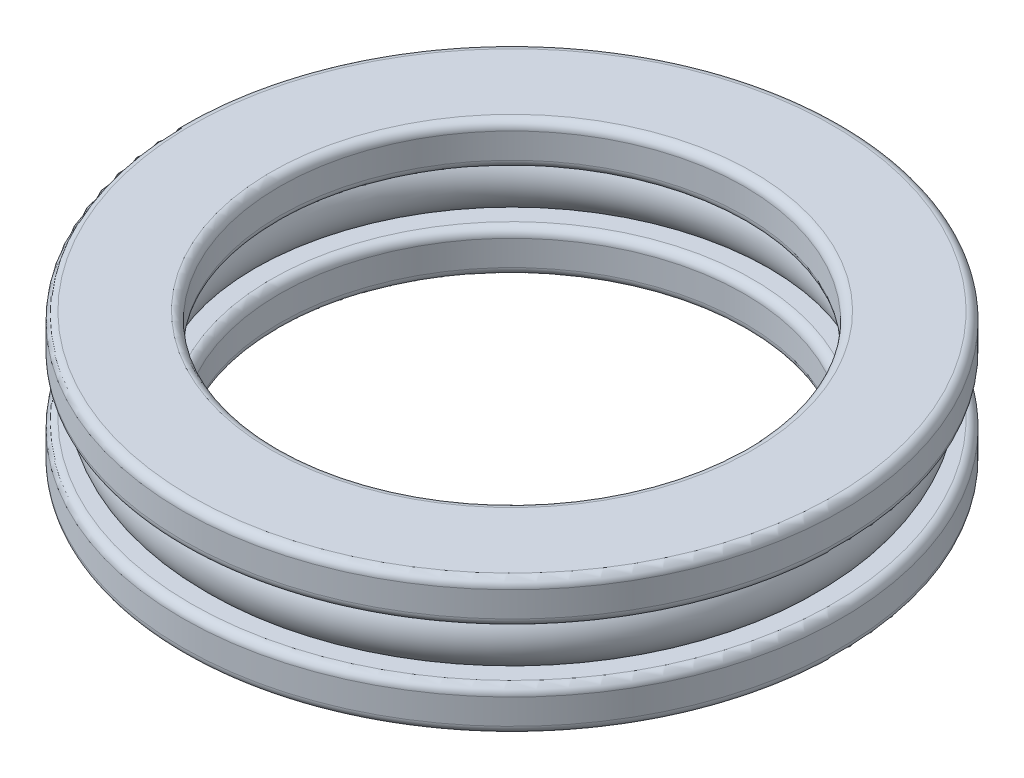
ISO-10303-21;
HEADER;
FILE_DESCRIPTION(('STEP AP214'),'2;1');
FILE_NAME('part.step','',(''),(''),'','','');
FILE_SCHEMA(('AUTOMOTIVE_DESIGN { 1 0 10303 214 1 1 1 1 }'));
ENDSEC;
DATA;
#1=APPLICATION_CONTEXT('core data for automotive mechanical design processes');
#2=APPLICATION_PROTOCOL_DEFINITION('international standard','automotive_design',2000,#1);
#3=PRODUCT_CONTEXT('',#1,'mechanical');
#4=PRODUCT('Part','Part','',(#3));
#5=PRODUCT_RELATED_PRODUCT_CATEGORY('part','',(#4));
#6=PRODUCT_DEFINITION_FORMATION('','',#4);
#7=PRODUCT_DEFINITION_CONTEXT('part definition',#1,'design');
#8=PRODUCT_DEFINITION('design','',#6,#7);
#9=PRODUCT_DEFINITION_SHAPE('','',#8);
#10=(LENGTH_UNIT() NAMED_UNIT(*) SI_UNIT(.MILLI.,.METRE.));
#11=(NAMED_UNIT(*) PLANE_ANGLE_UNIT() SI_UNIT($,.RADIAN.));
#12=(NAMED_UNIT(*) SI_UNIT($,.STERADIAN.) SOLID_ANGLE_UNIT());
#13=UNCERTAINTY_MEASURE_WITH_UNIT(LENGTH_MEASURE(1.E-05),#10,'distance_accuracy_value','');
#14=(GEOMETRIC_REPRESENTATION_CONTEXT(3) GLOBAL_UNCERTAINTY_ASSIGNED_CONTEXT((#13)) GLOBAL_UNIT_ASSIGNED_CONTEXT((#10,
#11,#12)) REPRESENTATION_CONTEXT('',''));
#15=CARTESIAN_POINT('',(0.,0.,0.));
#16=DIRECTION('',(0.,0.,1.));
#17=DIRECTION('',(1.,0.,0.));
#18=AXIS2_PLACEMENT_3D('',#15,#16,#17);
#19=CARTESIAN_POINT('',(0.,0.,0.));
#20=DIRECTION('',(0.,-1.,0.));
#21=DIRECTION('',(0.,0.,-1.));
#22=AXIS2_PLACEMENT_3D('',#19,#20,#21);
#23=CYLINDRICAL_SURFACE('',#22,39.);
#24=CARTESIAN_POINT('',(0.,-4.,0.));
#25=DIRECTION('',(0.,1.,0.));
#26=DIRECTION('',(0.,0.,1.));
#27=AXIS2_PLACEMENT_3D('',#24,#25,#26);
#28=CIRCLE('',#27,39.);
#29=CARTESIAN_POINT('',(0.,-4.,39.));
#30=VERTEX_POINT('',#29);
#31=EDGE_CURVE('E65',#30,#30,#28,.F.);
#32=ORIENTED_EDGE('',*,*,#31,.T.);
#33=EDGE_LOOP('',(#32));
#34=FACE_BOUND('',#33,.T.);
#35=CARTESIAN_POINT('',(0.,-7.,0.));
#36=DIRECTION('',(0.,-1.,0.));
#37=DIRECTION('',(0.,0.,-1.));
#38=AXIS2_PLACEMENT_3D('',#35,#36,#37);
#39=CIRCLE('',#38,39.);
#40=CARTESIAN_POINT('',(0.,-7.,-39.));
#41=VERTEX_POINT('',#40);
#42=EDGE_CURVE('E69',#41,#41,#39,.F.);
#43=ORIENTED_EDGE('',*,*,#42,.T.);
#44=EDGE_LOOP('',(#43));
#45=FACE_BOUND('',#44,.T.);
#46=ADVANCED_FACE('F37',(#34,#45),#23,.T.);
#47=CARTESIAN_POINT('',(35.8957513110646,-3.,0.));
#48=DIRECTION('',(0.,1.,0.));
#49=DIRECTION('',(0.,0.,1.));
#50=AXIS2_PLACEMENT_3D('',#47,#48,#49);
#51=PLANE('',#50);
#52=CARTESIAN_POINT('',(0.,-3.,0.));
#53=DIRECTION('',(0.,1.,0.));
#54=DIRECTION('',(0.,0.,1.));
#55=AXIS2_PLACEMENT_3D('',#52,#53,#54);
#56=CIRCLE('',#55,38.);
#57=CARTESIAN_POINT('',(0.,-3.,38.));
#58=VERTEX_POINT('',#57);
#59=EDGE_CURVE('E61',#58,#58,#56,.T.);
#60=ORIENTED_EDGE('',*,*,#59,.T.);
#61=EDGE_LOOP('',(#60));
#62=FACE_BOUND('',#61,.T.);
#63=CARTESIAN_POINT('',(0.,-3.,0.));
#64=DIRECTION('',(0.,-1.,0.));
#65=DIRECTION('',(0.,0.,-1.));
#66=AXIS2_PLACEMENT_3D('',#63,#64,#65);
#67=CIRCLE('',#66,35.8957513110646);
#68=CARTESIAN_POINT('',(0.,-3.,-35.8957513110646));
#69=VERTEX_POINT('',#68);
#70=EDGE_CURVE('E109',#69,#69,#67,.T.);
#71=ORIENTED_EDGE('',*,*,#70,.T.);
#72=EDGE_LOOP('',(#71));
#73=FACE_BOUND('',#72,.T.);
#74=ADVANCED_FACE('F144',(#62,#73),#51,.T.);
#75=CARTESIAN_POINT('',(0.,0.,0.));
#76=DIRECTION('',(0.,-1.,0.));
#77=DIRECTION('',(0.,0.,-1.));
#78=AXIS2_PLACEMENT_3D('',#75,#76,#77);
#79=TOROIDAL_SURFACE('',#78,33.25,4.00000000000001);
#80=CARTESIAN_POINT('',(0.,3.,0.));
#81=DIRECTION('',(0.,-1.,0.));
#82=DIRECTION('',(0.,0.,-1.));
#83=AXIS2_PLACEMENT_3D('',#80,#81,#82);
#84=CIRCLE('',#83,35.8957513110646);
#85=CARTESIAN_POINT('',(0.,3.,-35.8957513110646));
#86=VERTEX_POINT('',#85);
#87=EDGE_CURVE('E113',#86,#86,#84,.T.);
#88=ORIENTED_EDGE('',*,*,#87,.T.);
#89=EDGE_LOOP('',(#88));
#90=FACE_BOUND('',#89,.T.);
#91=ORIENTED_EDGE('',*,*,#70,.F.);
#92=EDGE_LOOP('',(#91));
#93=FACE_BOUND('',#92,.T.);
#94=ADVANCED_FACE('F150',(#90,#93),#79,.T.);
#95=CARTESIAN_POINT('',(35.8957513110646,3.,0.));
#96=DIRECTION('',(0.,-1.,0.));
#97=DIRECTION('',(0.,0.,-1.));
#98=AXIS2_PLACEMENT_3D('',#95,#96,#97);
#99=PLANE('',#98);
#100=CARTESIAN_POINT('',(0.,3.,0.));
#101=DIRECTION('',(0.,-1.,0.));
#102=DIRECTION('',(0.,0.,-1.));
#103=AXIS2_PLACEMENT_3D('',#100,#101,#102);
#104=CIRCLE('',#103,38.);
#105=CARTESIAN_POINT('',(0.,3.,-38.));
#106=VERTEX_POINT('',#105);
#107=EDGE_CURVE('E81',#106,#106,#104,.T.);
#108=ORIENTED_EDGE('',*,*,#107,.T.);
#109=EDGE_LOOP('',(#108));
#110=FACE_BOUND('',#109,.T.);
#111=ORIENTED_EDGE('',*,*,#87,.F.);
#112=EDGE_LOOP('',(#111));
#113=FACE_BOUND('',#112,.T.);
#114=ADVANCED_FACE('F205',(#110,#113),#99,.T.);
#115=CARTESIAN_POINT('',(0.,0.,0.));
#116=DIRECTION('',(0.,-1.,0.));
#117=DIRECTION('',(0.,0.,-1.));
#118=AXIS2_PLACEMENT_3D('',#115,#116,#117);
#119=CYLINDRICAL_SURFACE('',#118,39.);
#120=CARTESIAN_POINT('',(0.,4.,0.));
#121=DIRECTION('',(0.,-1.,0.));
#122=DIRECTION('',(0.,0.,-1.));
#123=AXIS2_PLACEMENT_3D('',#120,#121,#122);
#124=CIRCLE('',#123,39.);
#125=CARTESIAN_POINT('',(0.,4.,-39.));
#126=VERTEX_POINT('',#125);
#127=EDGE_CURVE('E73',#126,#126,#124,.F.);
#128=ORIENTED_EDGE('',*,*,#127,.T.);
#129=EDGE_LOOP('',(#128));
#130=FACE_BOUND('',#129,.T.);
#131=CARTESIAN_POINT('',(0.,7.,0.));
#132=DIRECTION('',(0.,1.,0.));
#133=DIRECTION('',(0.,0.,1.));
#134=AXIS2_PLACEMENT_3D('',#131,#132,#133);
#135=CIRCLE('',#134,39.);
#136=CARTESIAN_POINT('',(0.,7.,39.));
#137=VERTEX_POINT('',#136);
#138=EDGE_CURVE('E77',#137,#137,#135,.F.);
#139=ORIENTED_EDGE('',*,*,#138,.T.);
#140=EDGE_LOOP('',(#139));
#141=FACE_BOUND('',#140,.T.);
#142=ADVANCED_FACE('F200',(#130,#141),#119,.T.);
#143=CARTESIAN_POINT('',(27.5,8.,0.));
#144=DIRECTION('',(0.,1.,0.));
#145=DIRECTION('',(0.,0.,1.));
#146=AXIS2_PLACEMENT_3D('',#143,#144,#145);
#147=PLANE('',#146);
#148=CARTESIAN_POINT('',(0.,8.,0.));
#149=DIRECTION('',(0.,1.,0.));
#150=DIRECTION('',(0.,0.,1.));
#151=AXIS2_PLACEMENT_3D('',#148,#149,#150);
#152=CIRCLE('',#151,28.5);
#153=CARTESIAN_POINT('',(0.,8.,28.5));
#154=VERTEX_POINT('',#153);
#155=EDGE_CURVE('E10',#154,#154,#152,.F.);
#156=ORIENTED_EDGE('',*,*,#155,.T.);
#157=EDGE_LOOP('',(#156));
#158=FACE_BOUND('',#157,.T.);
#159=CARTESIAN_POINT('',(0.,8.,0.));
#160=DIRECTION('',(0.,1.,0.));
#161=DIRECTION('',(0.,0.,1.));
#162=AXIS2_PLACEMENT_3D('',#159,#160,#161);
#163=CIRCLE('',#162,38.);
#164=CARTESIAN_POINT('',(0.,8.,38.));
#165=VERTEX_POINT('',#164);
#166=EDGE_CURVE('E45',#165,#165,#163,.T.);
#167=ORIENTED_EDGE('',*,*,#166,.T.);
#168=EDGE_LOOP('',(#167));
#169=FACE_BOUND('',#168,.T.);
#170=ADVANCED_FACE('F191',(#158,#169),#147,.T.);
#171=CARTESIAN_POINT('',(0.,0.,0.));
#172=DIRECTION('',(0.,-1.,0.));
#173=DIRECTION('',(0.,0.,-1.));
#174=AXIS2_PLACEMENT_3D('',#171,#172,#173);
#175=CYLINDRICAL_SURFACE('',#174,27.5);
#176=CARTESIAN_POINT('',(0.,4.,0.));
#177=DIRECTION('',(0.,-1.,0.));
#178=DIRECTION('',(0.,0.,-1.));
#179=AXIS2_PLACEMENT_3D('',#176,#177,#178);
#180=CIRCLE('',#179,27.5);
#181=CARTESIAN_POINT('',(0.,4.,-27.5));
#182=VERTEX_POINT('',#181);
#183=EDGE_CURVE('E89',#182,#182,#180,.T.);
#184=ORIENTED_EDGE('',*,*,#183,.T.);
#185=EDGE_LOOP('',(#184));
#186=FACE_BOUND('',#185,.T.);
#187=CARTESIAN_POINT('',(0.,7.,0.));
#188=DIRECTION('',(0.,1.,0.));
#189=DIRECTION('',(0.,0.,1.));
#190=AXIS2_PLACEMENT_3D('',#187,#188,#189);
#191=CIRCLE('',#190,27.5);
#192=CARTESIAN_POINT('',(0.,7.,27.5));
#193=VERTEX_POINT('',#192);
#194=EDGE_CURVE('E93',#193,#193,#191,.T.);
#195=ORIENTED_EDGE('',*,*,#194,.T.);
#196=EDGE_LOOP('',(#195));
#197=FACE_BOUND('',#196,.T.);
#198=ADVANCED_FACE('F189',(#186,#197),#175,.F.);
#199=CARTESIAN_POINT('',(27.5,3.,0.));
#200=DIRECTION('',(0.,-1.,0.));
#201=DIRECTION('',(0.,0.,-1.));
#202=AXIS2_PLACEMENT_3D('',#199,#200,#201);
#203=PLANE('',#202);
#204=CARTESIAN_POINT('',(0.,3.,0.));
#205=DIRECTION('',(0.,-1.,0.));
#206=DIRECTION('',(0.,0.,-1.));
#207=AXIS2_PLACEMENT_3D('',#204,#205,#206);
#208=CIRCLE('',#207,28.5);
#209=CARTESIAN_POINT('',(0.,3.,-28.5));
#210=VERTEX_POINT('',#209);
#211=EDGE_CURVE('E85',#210,#210,#208,.F.);
#212=ORIENTED_EDGE('',*,*,#211,.T.);
#213=EDGE_LOOP('',(#212));
#214=FACE_BOUND('',#213,.T.);
#215=CARTESIAN_POINT('',(0.,3.,0.));
#216=DIRECTION('',(0.,-1.,0.));
#217=DIRECTION('',(0.,0.,-1.));
#218=AXIS2_PLACEMENT_3D('',#215,#216,#217);
#219=CIRCLE('',#218,30.6042486889354);
#220=CARTESIAN_POINT('',(0.,3.,-30.6042486889354));
#221=VERTEX_POINT('',#220);
#222=EDGE_CURVE('E117',#221,#221,#219,.T.);
#223=ORIENTED_EDGE('',*,*,#222,.T.);
#224=EDGE_LOOP('',(#223));
#225=FACE_BOUND('',#224,.T.);
#226=ADVANCED_FACE('F141',(#214,#225),#203,.T.);
#227=CARTESIAN_POINT('',(0.,0.,0.));
#228=DIRECTION('',(0.,-1.,0.));
#229=DIRECTION('',(0.,0.,-1.));
#230=AXIS2_PLACEMENT_3D('',#227,#228,#229);
#231=TOROIDAL_SURFACE('',#230,33.25,4.);
#232=CARTESIAN_POINT('',(0.,-3.,0.));
#233=DIRECTION('',(0.,-1.,0.));
#234=DIRECTION('',(0.,0.,-1.));
#235=AXIS2_PLACEMENT_3D('',#232,#233,#234);
#236=CIRCLE('',#235,30.6042486889354);
#237=CARTESIAN_POINT('',(0.,-3.,-30.6042486889354));
#238=VERTEX_POINT('',#237);
#239=EDGE_CURVE('E121',#238,#238,#236,.T.);
#240=ORIENTED_EDGE('',*,*,#239,.T.);
#241=EDGE_LOOP('',(#240));
#242=FACE_BOUND('',#241,.T.);
#243=ORIENTED_EDGE('',*,*,#222,.F.);
#244=EDGE_LOOP('',(#243));
#245=FACE_BOUND('',#244,.T.);
#246=ADVANCED_FACE('F126',(#242,#245),#231,.T.);
#247=CARTESIAN_POINT('',(27.5,-3.,0.));
#248=DIRECTION('',(0.,1.,0.));
#249=DIRECTION('',(0.,0.,1.));
#250=AXIS2_PLACEMENT_3D('',#247,#248,#249);
#251=PLANE('',#250);
#252=CARTESIAN_POINT('',(0.,-3.,0.));
#253=DIRECTION('',(0.,1.,0.));
#254=DIRECTION('',(0.,0.,1.));
#255=AXIS2_PLACEMENT_3D('',#252,#253,#254);
#256=CIRCLE('',#255,28.5);
#257=CARTESIAN_POINT('',(0.,-3.,28.5));
#258=VERTEX_POINT('',#257);
#259=EDGE_CURVE('E105',#258,#258,#256,.F.);
#260=ORIENTED_EDGE('',*,*,#259,.T.);
#261=EDGE_LOOP('',(#260));
#262=FACE_BOUND('',#261,.T.);
#263=ORIENTED_EDGE('',*,*,#239,.F.);
#264=EDGE_LOOP('',(#263));
#265=FACE_BOUND('',#264,.T.);
#266=ADVANCED_FACE('F129',(#262,#265),#251,.T.);
#267=CARTESIAN_POINT('',(0.,0.,0.));
#268=DIRECTION('',(0.,-1.,0.));
#269=DIRECTION('',(0.,0.,-1.));
#270=AXIS2_PLACEMENT_3D('',#267,#268,#269);
#271=CYLINDRICAL_SURFACE('',#270,27.5);
#272=CARTESIAN_POINT('',(0.,-4.,0.));
#273=DIRECTION('',(0.,1.,0.));
#274=DIRECTION('',(0.,0.,1.));
#275=AXIS2_PLACEMENT_3D('',#272,#273,#274);
#276=CIRCLE('',#275,27.5);
#277=CARTESIAN_POINT('',(0.,-4.,27.5));
#278=VERTEX_POINT('',#277);
#279=EDGE_CURVE('E97',#278,#278,#276,.T.);
#280=ORIENTED_EDGE('',*,*,#279,.T.);
#281=EDGE_LOOP('',(#280));
#282=FACE_BOUND('',#281,.T.);
#283=CARTESIAN_POINT('',(0.,-7.,0.));
#284=DIRECTION('',(0.,-1.,0.));
#285=DIRECTION('',(0.,0.,-1.));
#286=AXIS2_PLACEMENT_3D('',#283,#284,#285);
#287=CIRCLE('',#286,27.5);
#288=CARTESIAN_POINT('',(0.,-7.,-27.5));
#289=VERTEX_POINT('',#288);
#290=EDGE_CURVE('E101',#289,#289,#287,.T.);
#291=ORIENTED_EDGE('',*,*,#290,.T.);
#292=EDGE_LOOP('',(#291));
#293=FACE_BOUND('',#292,.T.);
#294=ADVANCED_FACE('F131',(#282,#293),#271,.F.);
#295=CARTESIAN_POINT('',(27.5,-8.,0.));
#296=DIRECTION('',(0.,-1.,0.));
#297=DIRECTION('',(0.,0.,-1.));
#298=AXIS2_PLACEMENT_3D('',#295,#296,#297);
#299=PLANE('',#298);
#300=CARTESIAN_POINT('',(0.,-8.,0.));
#301=DIRECTION('',(0.,-1.,0.));
#302=DIRECTION('',(0.,0.,-1.));
#303=AXIS2_PLACEMENT_3D('',#300,#301,#302);
#304=CIRCLE('',#303,38.);
#305=CARTESIAN_POINT('',(0.,-8.,-38.));
#306=VERTEX_POINT('',#305);
#307=EDGE_CURVE('E50',#306,#306,#304,.T.);
#308=ORIENTED_EDGE('',*,*,#307,.T.);
#309=EDGE_LOOP('',(#308));
#310=FACE_BOUND('',#309,.T.);
#311=CARTESIAN_POINT('',(0.,-8.,0.));
#312=DIRECTION('',(0.,-1.,0.));
#313=DIRECTION('',(0.,0.,-1.));
#314=AXIS2_PLACEMENT_3D('',#311,#312,#313);
#315=CIRCLE('',#314,28.5);
#316=CARTESIAN_POINT('',(0.,-8.,-28.5));
#317=VERTEX_POINT('',#316);
#318=EDGE_CURVE('E55',#317,#317,#315,.F.);
#319=ORIENTED_EDGE('',*,*,#318,.T.);
#320=EDGE_LOOP('',(#319));
#321=FACE_BOUND('',#320,.T.);
#322=ADVANCED_FACE('F138',(#310,#321),#299,.T.);
#323=CARTESIAN_POINT('',(0.,-4.,0.));
#324=DIRECTION('',(0.,1.,0.));
#325=DIRECTION('',(0.,0.,1.));
#326=AXIS2_PLACEMENT_3D('',#323,#324,#325);
#327=TOROIDAL_SURFACE('',#326,28.5,1.);
#328=ORIENTED_EDGE('',*,*,#279,.F.);
#329=EDGE_LOOP('',(#328));
#330=FACE_BOUND('',#329,.T.);
#331=ORIENTED_EDGE('',*,*,#259,.F.);
#332=EDGE_LOOP('',(#331));
#333=FACE_BOUND('',#332,.T.);
#334=ADVANCED_FACE('F156',(#330,#333),#327,.T.);
#335=CARTESIAN_POINT('',(0.,4.,0.));
#336=DIRECTION('',(0.,-1.,0.));
#337=DIRECTION('',(0.,0.,-1.));
#338=AXIS2_PLACEMENT_3D('',#335,#336,#337);
#339=TOROIDAL_SURFACE('',#338,28.5,1.);
#340=ORIENTED_EDGE('',*,*,#211,.F.);
#341=EDGE_LOOP('',(#340));
#342=FACE_BOUND('',#341,.T.);
#343=ORIENTED_EDGE('',*,*,#183,.F.);
#344=EDGE_LOOP('',(#343));
#345=FACE_BOUND('',#344,.T.);
#346=ADVANCED_FACE('F159',(#342,#345),#339,.T.);
#347=CARTESIAN_POINT('',(0.,4.,0.));
#348=DIRECTION('',(0.,-1.,0.));
#349=DIRECTION('',(0.,0.,-1.));
#350=AXIS2_PLACEMENT_3D('',#347,#348,#349);
#351=TOROIDAL_SURFACE('',#350,38.,1.);
#352=ORIENTED_EDGE('',*,*,#127,.F.);
#353=EDGE_LOOP('',(#352));
#354=FACE_BOUND('',#353,.T.);
#355=ORIENTED_EDGE('',*,*,#107,.F.);
#356=EDGE_LOOP('',(#355));
#357=FACE_BOUND('',#356,.T.);
#358=ADVANCED_FACE('F163',(#354,#357),#351,.T.);
#359=CARTESIAN_POINT('',(0.,-4.,0.));
#360=DIRECTION('',(0.,1.,0.));
#361=DIRECTION('',(0.,0.,1.));
#362=AXIS2_PLACEMENT_3D('',#359,#360,#361);
#363=TOROIDAL_SURFACE('',#362,38.,1.);
#364=ORIENTED_EDGE('',*,*,#59,.F.);
#365=EDGE_LOOP('',(#364));
#366=FACE_BOUND('',#365,.T.);
#367=ORIENTED_EDGE('',*,*,#31,.F.);
#368=EDGE_LOOP('',(#367));
#369=FACE_BOUND('',#368,.T.);
#370=ADVANCED_FACE('F167',(#366,#369),#363,.T.);
#371=CARTESIAN_POINT('',(0.,-7.,0.));
#372=DIRECTION('',(0.,-1.,0.));
#373=DIRECTION('',(0.,0.,-1.));
#374=AXIS2_PLACEMENT_3D('',#371,#372,#373);
#375=TOROIDAL_SURFACE('',#374,38.,1.);
#376=ORIENTED_EDGE('',*,*,#42,.F.);
#377=EDGE_LOOP('',(#376));
#378=FACE_BOUND('',#377,.T.);
#379=ORIENTED_EDGE('',*,*,#307,.F.);
#380=EDGE_LOOP('',(#379));
#381=FACE_BOUND('',#380,.T.);
#382=ADVANCED_FACE('F171',(#378,#381),#375,.T.);
#383=CARTESIAN_POINT('',(0.,-7.,0.));
#384=DIRECTION('',(0.,-1.,0.));
#385=DIRECTION('',(0.,0.,-1.));
#386=AXIS2_PLACEMENT_3D('',#383,#384,#385);
#387=TOROIDAL_SURFACE('',#386,28.5,1.);
#388=ORIENTED_EDGE('',*,*,#318,.F.);
#389=EDGE_LOOP('',(#388));
#390=FACE_BOUND('',#389,.T.);
#391=ORIENTED_EDGE('',*,*,#290,.F.);
#392=EDGE_LOOP('',(#391));
#393=FACE_BOUND('',#392,.T.);
#394=ADVANCED_FACE('F175',(#390,#393),#387,.T.);
#395=CARTESIAN_POINT('',(0.,7.,0.));
#396=DIRECTION('',(0.,1.,0.));
#397=DIRECTION('',(0.,0.,1.));
#398=AXIS2_PLACEMENT_3D('',#395,#396,#397);
#399=TOROIDAL_SURFACE('',#398,28.5,1.);
#400=ORIENTED_EDGE('',*,*,#194,.F.);
#401=EDGE_LOOP('',(#400));
#402=FACE_BOUND('',#401,.T.);
#403=ORIENTED_EDGE('',*,*,#155,.F.);
#404=EDGE_LOOP('',(#403));
#405=FACE_BOUND('',#404,.T.);
#406=ADVANCED_FACE('F178',(#402,#405),#399,.T.);
#407=CARTESIAN_POINT('',(0.,7.,0.));
#408=DIRECTION('',(0.,1.,0.));
#409=DIRECTION('',(0.,0.,1.));
#410=AXIS2_PLACEMENT_3D('',#407,#408,#409);
#411=TOROIDAL_SURFACE('',#410,38.,1.);
#412=ORIENTED_EDGE('',*,*,#166,.F.);
#413=EDGE_LOOP('',(#412));
#414=FACE_BOUND('',#413,.T.);
#415=ORIENTED_EDGE('',*,*,#138,.F.);
#416=EDGE_LOOP('',(#415));
#417=FACE_BOUND('',#416,.T.);
#418=ADVANCED_FACE('F39',(#414,#417),#411,.T.);
#419=CLOSED_SHELL('',(#46,#74,#94,#114,#142,#170,#198,#226,#246,#266,#294,#322,#334,#346,#358,
#370,#382,#394,#406,#418));
#420=MANIFOLD_SOLID_BREP('B2',#419);
#421=ADVANCED_BREP_SHAPE_REPRESENTATION('',(#18,#420),#14);
#422=SHAPE_DEFINITION_REPRESENTATION(#9,#421);
ENDSEC;
END-ISO-10303-21;
